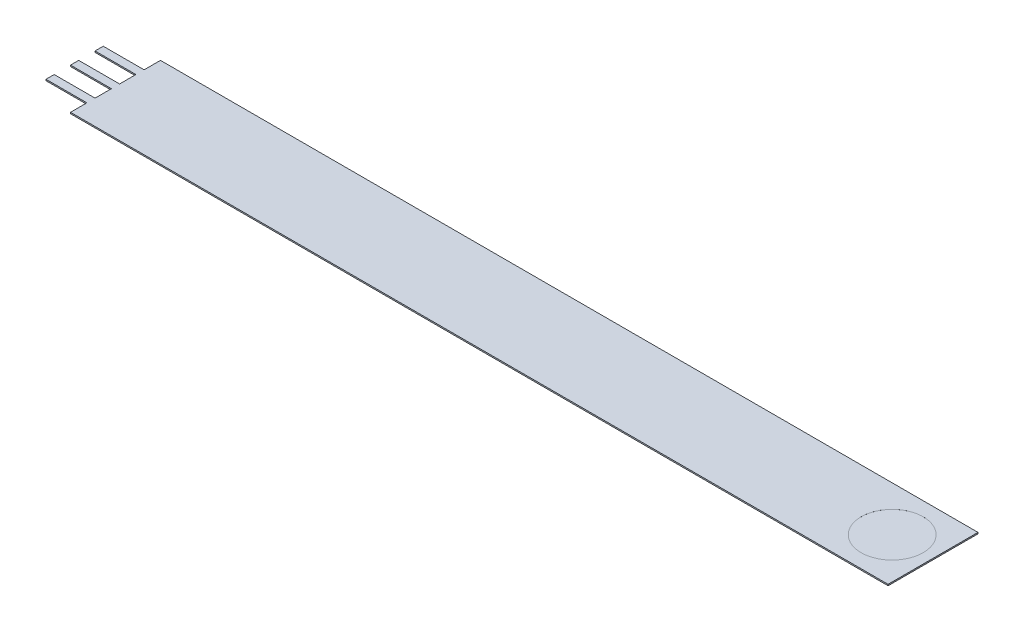
ISO-10303-21;
HEADER;
FILE_DESCRIPTION(('STEP AP214'),'2;1');
FILE_NAME('part.step','',(''),(''),'','','');
FILE_SCHEMA(('AUTOMOTIVE_DESIGN { 1 0 10303 214 1 1 1 1 }'));
ENDSEC;
DATA;
#1=APPLICATION_CONTEXT('core data for automotive mechanical design processes');
#2=APPLICATION_PROTOCOL_DEFINITION('international standard','automotive_design',2000,#1);
#3=PRODUCT_CONTEXT('',#1,'mechanical');
#4=PRODUCT('Part','Part','',(#3));
#5=PRODUCT_RELATED_PRODUCT_CATEGORY('part','',(#4));
#6=PRODUCT_DEFINITION_FORMATION('','',#4);
#7=PRODUCT_DEFINITION_CONTEXT('part definition',#1,'design');
#8=PRODUCT_DEFINITION('design','',#6,#7);
#9=PRODUCT_DEFINITION_SHAPE('','',#8);
#10=(LENGTH_UNIT() NAMED_UNIT(*) SI_UNIT(.MILLI.,.METRE.));
#11=(NAMED_UNIT(*) PLANE_ANGLE_UNIT() SI_UNIT($,.RADIAN.));
#12=(NAMED_UNIT(*) SI_UNIT($,.STERADIAN.) SOLID_ANGLE_UNIT());
#13=UNCERTAINTY_MEASURE_WITH_UNIT(LENGTH_MEASURE(1.E-05),#10,'distance_accuracy_value','');
#14=(GEOMETRIC_REPRESENTATION_CONTEXT(3) GLOBAL_UNCERTAINTY_ASSIGNED_CONTEXT((#13)) GLOBAL_UNIT_ASSIGNED_CONTEXT((#10,
#11,#12)) REPRESENTATION_CONTEXT('',''));
#15=CARTESIAN_POINT('',(0.,0.,0.));
#16=DIRECTION('',(0.,0.,1.));
#17=DIRECTION('',(1.,0.,0.));
#18=AXIS2_PLACEMENT_3D('',#15,#16,#17);
#19=CARTESIAN_POINT('',(-120.65,0.2032,-6.98499999999999));
#20=DIRECTION('',(1.,0.,0.));
#21=DIRECTION('',(0.,0.,-1.));
#22=AXIS2_PLACEMENT_3D('',#19,#20,#21);
#23=PLANE('',#22);
#24=DIRECTION('',(0.,0.,1.));
#25=VECTOR('',#24,1.);
#26=CARTESIAN_POINT('',(-120.65,0.,-6.98499999999999));
#27=LINE('',#26,#25);
#28=CARTESIAN_POINT('',(-120.65,0.,-6.98499999999999));
#29=VERTEX_POINT('',#28);
#30=CARTESIAN_POINT('',(-120.65,0.,-4.44499999999999));
#31=VERTEX_POINT('',#30);
#32=EDGE_CURVE('E189',#29,#31,#27,.T.);
#33=ORIENTED_EDGE('',*,*,#32,.T.);
#34=DIRECTION('',(0.,-1.,0.));
#35=VECTOR('',#34,1.);
#36=CARTESIAN_POINT('',(-120.65,0.2032,-4.44499999999999));
#37=LINE('',#36,#35);
#38=CARTESIAN_POINT('',(-120.65,0.2032,-4.44499999999999));
#39=VERTEX_POINT('',#38);
#40=EDGE_CURVE('E11',#39,#31,#37,.T.);
#41=ORIENTED_EDGE('',*,*,#40,.F.);
#42=DIRECTION('',(0.,0.,1.));
#43=VECTOR('',#42,1.);
#44=CARTESIAN_POINT('',(-120.65,0.2032,-6.98499999999999));
#45=LINE('',#44,#43);
#46=CARTESIAN_POINT('',(-120.65,0.2032,-6.98499999999999));
#47=VERTEX_POINT('',#46);
#48=EDGE_CURVE('E220',#47,#39,#45,.T.);
#49=ORIENTED_EDGE('',*,*,#48,.F.);
#50=DIRECTION('',(0.,-1.,0.));
#51=VECTOR('',#50,1.);
#52=CARTESIAN_POINT('',(-120.65,0.2032,-6.98499999999999));
#53=LINE('',#52,#51);
#54=EDGE_CURVE('E185',#47,#29,#53,.T.);
#55=ORIENTED_EDGE('',*,*,#54,.T.);
#56=EDGE_LOOP('',(#33,#41,#49,#55));
#57=FACE_BOUND('',#56,.T.);
#58=ADVANCED_FACE('F45',(#57),#23,.F.);
#59=CARTESIAN_POINT('',(-120.65,0.2032,-4.44499999999999));
#60=DIRECTION('',(0.,0.,1.));
#61=DIRECTION('',(1.,0.,0.));
#62=AXIS2_PLACEMENT_3D('',#59,#60,#61);
#63=PLANE('',#62);
#64=DIRECTION('',(-1.,0.,0.));
#65=VECTOR('',#64,1.);
#66=CARTESIAN_POINT('',(-120.65,0.,-4.44499999999999));
#67=LINE('',#66,#65);
#68=CARTESIAN_POINT('',(-127.,0.,-4.44499999999999));
#69=VERTEX_POINT('',#68);
#70=EDGE_CURVE('E192',#31,#69,#67,.T.);
#71=ORIENTED_EDGE('',*,*,#70,.T.);
#72=DIRECTION('',(0.,-1.,0.));
#73=VECTOR('',#72,1.);
#74=CARTESIAN_POINT('',(-127.,0.2032,-4.44499999999999));
#75=LINE('',#74,#73);
#76=CARTESIAN_POINT('',(-127.,0.2032,-4.44499999999999));
#77=VERTEX_POINT('',#76);
#78=EDGE_CURVE('E53',#77,#69,#75,.T.);
#79=ORIENTED_EDGE('',*,*,#78,.F.);
#80=DIRECTION('',(-1.,0.,0.));
#81=VECTOR('',#80,1.);
#82=CARTESIAN_POINT('',(-120.65,0.2032,-4.44499999999999));
#83=LINE('',#82,#81);
#84=EDGE_CURVE('E128',#39,#77,#83,.T.);
#85=ORIENTED_EDGE('',*,*,#84,.F.);
#86=ORIENTED_EDGE('',*,*,#40,.T.);
#87=EDGE_LOOP('',(#71,#79,#85,#86));
#88=FACE_BOUND('',#87,.T.);
#89=ADVANCED_FACE('F319',(#88),#63,.F.);
#90=CARTESIAN_POINT('',(-127.,0.2032,-3.17499999999999));
#91=DIRECTION('',(1.,0.,0.));
#92=DIRECTION('',(0.,0.,-1.));
#93=AXIS2_PLACEMENT_3D('',#90,#91,#92);
#94=PLANE('',#93);
#95=DIRECTION('',(0.,0.,1.));
#96=VECTOR('',#95,1.);
#97=CARTESIAN_POINT('',(-127.,0.,-3.17499999999999));
#98=LINE('',#97,#96);
#99=CARTESIAN_POINT('',(-127.,0.,-3.17499999999999));
#100=VERTEX_POINT('',#99);
#101=EDGE_CURVE('E195',#69,#100,#98,.T.);
#102=ORIENTED_EDGE('',*,*,#101,.T.);
#103=DIRECTION('',(0.,-1.,0.));
#104=VECTOR('',#103,1.);
#105=CARTESIAN_POINT('',(-127.,0.2032,-3.17499999999999));
#106=LINE('',#105,#104);
#107=CARTESIAN_POINT('',(-127.,0.2032,-3.17499999999999));
#108=VERTEX_POINT('',#107);
#109=EDGE_CURVE('E251',#108,#100,#106,.T.);
#110=ORIENTED_EDGE('',*,*,#109,.F.);
#111=DIRECTION('',(0.,0.,1.));
#112=VECTOR('',#111,1.);
#113=CARTESIAN_POINT('',(-127.,0.2032,-3.17499999999999));
#114=LINE('',#113,#112);
#115=EDGE_CURVE('E259',#77,#108,#114,.T.);
#116=ORIENTED_EDGE('',*,*,#115,.F.);
#117=ORIENTED_EDGE('',*,*,#78,.T.);
#118=EDGE_LOOP('',(#102,#110,#116,#117));
#119=FACE_BOUND('',#118,.T.);
#120=ADVANCED_FACE('F257',(#119),#94,.F.);
#121=CARTESIAN_POINT('',(-120.65,0.2032,-3.17499999999999));
#122=DIRECTION('',(0.,0.,-1.));
#123=DIRECTION('',(-1.,0.,0.));
#124=AXIS2_PLACEMENT_3D('',#121,#122,#123);
#125=PLANE('',#124);
#126=DIRECTION('',(1.,0.,0.));
#127=VECTOR('',#126,1.);
#128=CARTESIAN_POINT('',(-120.65,0.,-3.17499999999999));
#129=LINE('',#128,#127);
#130=CARTESIAN_POINT('',(-120.65,0.,-3.17499999999999));
#131=VERTEX_POINT('',#130);
#132=EDGE_CURVE('E197',#100,#131,#129,.T.);
#133=ORIENTED_EDGE('',*,*,#132,.T.);
#134=DIRECTION('',(0.,-1.,0.));
#135=VECTOR('',#134,1.);
#136=CARTESIAN_POINT('',(-120.65,0.2032,-3.17499999999999));
#137=LINE('',#136,#135);
#138=CARTESIAN_POINT('',(-120.65,0.2032,-3.17499999999999));
#139=VERTEX_POINT('',#138);
#140=EDGE_CURVE('E248',#139,#131,#137,.T.);
#141=ORIENTED_EDGE('',*,*,#140,.F.);
#142=DIRECTION('',(1.,0.,0.));
#143=VECTOR('',#142,1.);
#144=CARTESIAN_POINT('',(-120.65,0.2032,-3.17499999999999));
#145=LINE('',#144,#143);
#146=EDGE_CURVE('E277',#108,#139,#145,.T.);
#147=ORIENTED_EDGE('',*,*,#146,.F.);
#148=ORIENTED_EDGE('',*,*,#109,.T.);
#149=EDGE_LOOP('',(#133,#141,#147,#148));
#150=FACE_BOUND('',#149,.T.);
#151=ADVANCED_FACE('F268',(#150),#125,.F.);
#152=CARTESIAN_POINT('',(-120.65,0.2032,-3.17499999999999));
#153=DIRECTION('',(1.,0.,0.));
#154=DIRECTION('',(0.,0.,-1.));
#155=AXIS2_PLACEMENT_3D('',#152,#153,#154);
#156=PLANE('',#155);
#157=DIRECTION('',(0.,0.,1.));
#158=VECTOR('',#157,1.);
#159=CARTESIAN_POINT('',(-120.65,0.,-3.17499999999999));
#160=LINE('',#159,#158);
#161=CARTESIAN_POINT('',(-120.65,0.,-0.634999999999987));
#162=VERTEX_POINT('',#161);
#163=EDGE_CURVE('E199',#131,#162,#160,.T.);
#164=ORIENTED_EDGE('',*,*,#163,.T.);
#165=DIRECTION('',(0.,-1.,0.));
#166=VECTOR('',#165,1.);
#167=CARTESIAN_POINT('',(-120.65,0.2032,-0.634999999999987));
#168=LINE('',#167,#166);
#169=CARTESIAN_POINT('',(-120.65,0.2032,-0.634999999999987));
#170=VERTEX_POINT('',#169);
#171=EDGE_CURVE('E245',#170,#162,#168,.T.);
#172=ORIENTED_EDGE('',*,*,#171,.F.);
#173=DIRECTION('',(0.,0.,1.));
#174=VECTOR('',#173,1.);
#175=CARTESIAN_POINT('',(-120.65,0.2032,-3.17499999999999));
#176=LINE('',#175,#174);
#177=EDGE_CURVE('E274',#139,#170,#176,.T.);
#178=ORIENTED_EDGE('',*,*,#177,.F.);
#179=ORIENTED_EDGE('',*,*,#140,.T.);
#180=EDGE_LOOP('',(#164,#172,#178,#179));
#181=FACE_BOUND('',#180,.T.);
#182=ADVANCED_FACE('F272',(#181),#156,.F.);
#183=CARTESIAN_POINT('',(-120.65,0.2032,-0.634999999999987));
#184=DIRECTION('',(0.,0.,1.));
#185=DIRECTION('',(1.,0.,0.));
#186=AXIS2_PLACEMENT_3D('',#183,#184,#185);
#187=PLANE('',#186);
#188=DIRECTION('',(-1.,0.,0.));
#189=VECTOR('',#188,1.);
#190=CARTESIAN_POINT('',(-120.65,0.,-0.634999999999987));
#191=LINE('',#190,#189);
#192=CARTESIAN_POINT('',(-127.,0.,-0.634999999999988));
#193=VERTEX_POINT('',#192);
#194=EDGE_CURVE('E201',#162,#193,#191,.T.);
#195=ORIENTED_EDGE('',*,*,#194,.T.);
#196=DIRECTION('',(0.,-1.,0.));
#197=VECTOR('',#196,1.);
#198=CARTESIAN_POINT('',(-127.,0.2032,-0.634999999999988));
#199=LINE('',#198,#197);
#200=CARTESIAN_POINT('',(-127.,0.2032,-0.634999999999988));
#201=VERTEX_POINT('',#200);
#202=EDGE_CURVE('E242',#201,#193,#199,.T.);
#203=ORIENTED_EDGE('',*,*,#202,.F.);
#204=DIRECTION('',(-1.,0.,0.));
#205=VECTOR('',#204,1.);
#206=CARTESIAN_POINT('',(-120.65,0.2032,-0.634999999999987));
#207=LINE('',#206,#205);
#208=EDGE_CURVE('E276',#170,#201,#207,.T.);
#209=ORIENTED_EDGE('',*,*,#208,.F.);
#210=ORIENTED_EDGE('',*,*,#171,.T.);
#211=EDGE_LOOP('',(#195,#203,#209,#210));
#212=FACE_BOUND('',#211,.T.);
#213=ADVANCED_FACE('F332',(#212),#187,.F.);
#214=CARTESIAN_POINT('',(-127.,0.2032,0.635000000000013));
#215=DIRECTION('',(1.,0.,0.));
#216=DIRECTION('',(0.,0.,-1.));
#217=AXIS2_PLACEMENT_3D('',#214,#215,#216);
#218=PLANE('',#217);
#219=DIRECTION('',(0.,0.,1.));
#220=VECTOR('',#219,1.);
#221=CARTESIAN_POINT('',(-127.,0.,0.635000000000013));
#222=LINE('',#221,#220);
#223=CARTESIAN_POINT('',(-127.,0.,0.635000000000013));
#224=VERTEX_POINT('',#223);
#225=EDGE_CURVE('E203',#193,#224,#222,.T.);
#226=ORIENTED_EDGE('',*,*,#225,.T.);
#227=DIRECTION('',(0.,-1.,0.));
#228=VECTOR('',#227,1.);
#229=CARTESIAN_POINT('',(-127.,0.2032,0.635000000000013));
#230=LINE('',#229,#228);
#231=CARTESIAN_POINT('',(-127.,0.2032,0.635000000000013));
#232=VERTEX_POINT('',#231);
#233=EDGE_CURVE('E239',#232,#224,#230,.T.);
#234=ORIENTED_EDGE('',*,*,#233,.F.);
#235=DIRECTION('',(0.,0.,1.));
#236=VECTOR('',#235,1.);
#237=CARTESIAN_POINT('',(-127.,0.2032,0.635000000000013));
#238=LINE('',#237,#236);
#239=EDGE_CURVE('E279',#201,#232,#238,.T.);
#240=ORIENTED_EDGE('',*,*,#239,.F.);
#241=ORIENTED_EDGE('',*,*,#202,.T.);
#242=EDGE_LOOP('',(#226,#234,#240,#241));
#243=FACE_BOUND('',#242,.T.);
#244=ADVANCED_FACE('F335',(#243),#218,.F.);
#245=CARTESIAN_POINT('',(-120.65,0.2032,0.635000000000012));
#246=DIRECTION('',(0.,0.,-1.));
#247=DIRECTION('',(-1.,0.,0.));
#248=AXIS2_PLACEMENT_3D('',#245,#246,#247);
#249=PLANE('',#248);
#250=DIRECTION('',(1.,0.,0.));
#251=VECTOR('',#250,1.);
#252=CARTESIAN_POINT('',(-120.65,0.,0.635000000000012));
#253=LINE('',#252,#251);
#254=CARTESIAN_POINT('',(-120.65,0.,0.635000000000012));
#255=VERTEX_POINT('',#254);
#256=EDGE_CURVE('E205',#224,#255,#253,.T.);
#257=ORIENTED_EDGE('',*,*,#256,.T.);
#258=DIRECTION('',(0.,-1.,0.));
#259=VECTOR('',#258,1.);
#260=CARTESIAN_POINT('',(-120.65,0.2032,0.635000000000012));
#261=LINE('',#260,#259);
#262=CARTESIAN_POINT('',(-120.65,0.2032,0.635000000000012));
#263=VERTEX_POINT('',#262);
#264=EDGE_CURVE('E236',#263,#255,#261,.T.);
#265=ORIENTED_EDGE('',*,*,#264,.F.);
#266=DIRECTION('',(1.,0.,0.));
#267=VECTOR('',#266,1.);
#268=CARTESIAN_POINT('',(-120.65,0.2032,0.635000000000012));
#269=LINE('',#268,#267);
#270=EDGE_CURVE('E285',#232,#263,#269,.T.);
#271=ORIENTED_EDGE('',*,*,#270,.F.);
#272=ORIENTED_EDGE('',*,*,#233,.T.);
#273=EDGE_LOOP('',(#257,#265,#271,#272));
#274=FACE_BOUND('',#273,.T.);
#275=ADVANCED_FACE('F339',(#274),#249,.F.);
#276=CARTESIAN_POINT('',(-120.65,0.2032,0.635000000000012));
#277=DIRECTION('',(1.,0.,0.));
#278=DIRECTION('',(0.,0.,-1.));
#279=AXIS2_PLACEMENT_3D('',#276,#277,#278);
#280=PLANE('',#279);
#281=DIRECTION('',(0.,0.,1.));
#282=VECTOR('',#281,1.);
#283=CARTESIAN_POINT('',(-120.65,0.,0.635000000000012));
#284=LINE('',#283,#282);
#285=CARTESIAN_POINT('',(-120.65,0.,3.17500000000001));
#286=VERTEX_POINT('',#285);
#287=EDGE_CURVE('E207',#255,#286,#284,.T.);
#288=ORIENTED_EDGE('',*,*,#287,.T.);
#289=DIRECTION('',(0.,-1.,0.));
#290=VECTOR('',#289,1.);
#291=CARTESIAN_POINT('',(-120.65,0.2032,3.17500000000001));
#292=LINE('',#291,#290);
#293=CARTESIAN_POINT('',(-120.65,0.2032,3.17500000000001));
#294=VERTEX_POINT('',#293);
#295=EDGE_CURVE('E233',#294,#286,#292,.T.);
#296=ORIENTED_EDGE('',*,*,#295,.F.);
#297=DIRECTION('',(0.,0.,1.));
#298=VECTOR('',#297,1.);
#299=CARTESIAN_POINT('',(-120.65,0.2032,0.635000000000012));
#300=LINE('',#299,#298);
#301=EDGE_CURVE('E287',#263,#294,#300,.T.);
#302=ORIENTED_EDGE('',*,*,#301,.F.);
#303=ORIENTED_EDGE('',*,*,#264,.T.);
#304=EDGE_LOOP('',(#288,#296,#302,#303));
#305=FACE_BOUND('',#304,.T.);
#306=ADVANCED_FACE('F343',(#305),#280,.F.);
#307=CARTESIAN_POINT('',(-120.65,0.2032,3.17500000000001));
#308=DIRECTION('',(0.,0.,1.));
#309=DIRECTION('',(1.,0.,0.));
#310=AXIS2_PLACEMENT_3D('',#307,#308,#309);
#311=PLANE('',#310);
#312=DIRECTION('',(-1.,0.,0.));
#313=VECTOR('',#312,1.);
#314=CARTESIAN_POINT('',(-120.65,0.,3.17500000000001));
#315=LINE('',#314,#313);
#316=CARTESIAN_POINT('',(-127.,0.,3.17500000000001));
#317=VERTEX_POINT('',#316);
#318=EDGE_CURVE('E209',#286,#317,#315,.T.);
#319=ORIENTED_EDGE('',*,*,#318,.T.);
#320=DIRECTION('',(0.,-1.,0.));
#321=VECTOR('',#320,1.);
#322=CARTESIAN_POINT('',(-127.,0.2032,3.17500000000001));
#323=LINE('',#322,#321);
#324=CARTESIAN_POINT('',(-127.,0.2032,3.17500000000001));
#325=VERTEX_POINT('',#324);
#326=EDGE_CURVE('E230',#325,#317,#323,.T.);
#327=ORIENTED_EDGE('',*,*,#326,.F.);
#328=DIRECTION('',(-1.,0.,0.));
#329=VECTOR('',#328,1.);
#330=CARTESIAN_POINT('',(-120.65,0.2032,3.17500000000001));
#331=LINE('',#330,#329);
#332=EDGE_CURVE('E289',#294,#325,#331,.T.);
#333=ORIENTED_EDGE('',*,*,#332,.F.);
#334=ORIENTED_EDGE('',*,*,#295,.T.);
#335=EDGE_LOOP('',(#319,#327,#333,#334));
#336=FACE_BOUND('',#335,.T.);
#337=ADVANCED_FACE('F347',(#336),#311,.F.);
#338=CARTESIAN_POINT('',(-127.,0.2032,3.17500000000001));
#339=DIRECTION('',(1.,0.,0.));
#340=DIRECTION('',(0.,0.,-1.));
#341=AXIS2_PLACEMENT_3D('',#338,#339,#340);
#342=PLANE('',#341);
#343=DIRECTION('',(0.,0.,1.));
#344=VECTOR('',#343,1.);
#345=CARTESIAN_POINT('',(-127.,0.,3.17500000000001));
#346=LINE('',#345,#344);
#347=CARTESIAN_POINT('',(-127.,0.,4.44500000000001));
#348=VERTEX_POINT('',#347);
#349=EDGE_CURVE('E211',#317,#348,#346,.T.);
#350=ORIENTED_EDGE('',*,*,#349,.T.);
#351=DIRECTION('',(0.,-1.,0.));
#352=VECTOR('',#351,1.);
#353=CARTESIAN_POINT('',(-127.,0.2032,4.44500000000001));
#354=LINE('',#353,#352);
#355=CARTESIAN_POINT('',(-127.,0.2032,4.44500000000001));
#356=VERTEX_POINT('',#355);
#357=EDGE_CURVE('E227',#356,#348,#354,.T.);
#358=ORIENTED_EDGE('',*,*,#357,.F.);
#359=DIRECTION('',(0.,0.,1.));
#360=VECTOR('',#359,1.);
#361=CARTESIAN_POINT('',(-127.,0.2032,3.17500000000001));
#362=LINE('',#361,#360);
#363=EDGE_CURVE('E291',#325,#356,#362,.T.);
#364=ORIENTED_EDGE('',*,*,#363,.F.);
#365=ORIENTED_EDGE('',*,*,#326,.T.);
#366=EDGE_LOOP('',(#350,#358,#364,#365));
#367=FACE_BOUND('',#366,.T.);
#368=ADVANCED_FACE('F351',(#367),#342,.F.);
#369=CARTESIAN_POINT('',(-120.65,0.2032,4.44500000000001));
#370=DIRECTION('',(0.,0.,-1.));
#371=DIRECTION('',(-1.,0.,0.));
#372=AXIS2_PLACEMENT_3D('',#369,#370,#371);
#373=PLANE('',#372);
#374=DIRECTION('',(1.,0.,0.));
#375=VECTOR('',#374,1.);
#376=CARTESIAN_POINT('',(-120.65,0.,4.44500000000001));
#377=LINE('',#376,#375);
#378=CARTESIAN_POINT('',(-120.65,0.,4.44500000000001));
#379=VERTEX_POINT('',#378);
#380=EDGE_CURVE('E213',#348,#379,#377,.T.);
#381=ORIENTED_EDGE('',*,*,#380,.T.);
#382=DIRECTION('',(0.,-1.,0.));
#383=VECTOR('',#382,1.);
#384=CARTESIAN_POINT('',(-120.65,0.2032,4.44500000000001));
#385=LINE('',#384,#383);
#386=CARTESIAN_POINT('',(-120.65,0.2032,4.44500000000001));
#387=VERTEX_POINT('',#386);
#388=EDGE_CURVE('E224',#387,#379,#385,.T.);
#389=ORIENTED_EDGE('',*,*,#388,.F.);
#390=DIRECTION('',(1.,0.,0.));
#391=VECTOR('',#390,1.);
#392=CARTESIAN_POINT('',(-120.65,0.2032,4.44500000000001));
#393=LINE('',#392,#391);
#394=EDGE_CURVE('E293',#356,#387,#393,.T.);
#395=ORIENTED_EDGE('',*,*,#394,.F.);
#396=ORIENTED_EDGE('',*,*,#357,.T.);
#397=EDGE_LOOP('',(#381,#389,#395,#396));
#398=FACE_BOUND('',#397,.T.);
#399=ADVANCED_FACE('F299',(#398),#373,.F.);
#400=CARTESIAN_POINT('',(-120.65,0.2032,4.44500000000001));
#401=DIRECTION('',(1.,0.,0.));
#402=DIRECTION('',(0.,0.,-1.));
#403=AXIS2_PLACEMENT_3D('',#400,#401,#402);
#404=PLANE('',#403);
#405=DIRECTION('',(0.,0.,1.));
#406=VECTOR('',#405,1.);
#407=CARTESIAN_POINT('',(-120.65,0.,4.44500000000001));
#408=LINE('',#407,#406);
#409=CARTESIAN_POINT('',(-120.65,0.,6.98500000000001));
#410=VERTEX_POINT('',#409);
#411=EDGE_CURVE('E215',#379,#410,#408,.T.);
#412=ORIENTED_EDGE('',*,*,#411,.T.);
#413=DIRECTION('',(0.,-1.,0.));
#414=VECTOR('',#413,1.);
#415=CARTESIAN_POINT('',(-120.65,0.2032,6.98500000000001));
#416=LINE('',#415,#414);
#417=CARTESIAN_POINT('',(-120.65,0.2032,6.98500000000001));
#418=VERTEX_POINT('',#417);
#419=EDGE_CURVE('E180',#418,#410,#416,.T.);
#420=ORIENTED_EDGE('',*,*,#419,.F.);
#421=DIRECTION('',(0.,0.,1.));
#422=VECTOR('',#421,1.);
#423=CARTESIAN_POINT('',(-120.65,0.2032,4.44500000000001));
#424=LINE('',#423,#422);
#425=EDGE_CURVE('E171',#387,#418,#424,.T.);
#426=ORIENTED_EDGE('',*,*,#425,.F.);
#427=ORIENTED_EDGE('',*,*,#388,.T.);
#428=EDGE_LOOP('',(#412,#420,#426,#427));
#429=FACE_BOUND('',#428,.T.);
#430=ADVANCED_FACE('F303',(#429),#404,.F.);
#431=CARTESIAN_POINT('',(-120.65,0.2032,6.98500000000001));
#432=DIRECTION('',(0.,0.,-1.));
#433=DIRECTION('',(-1.,0.,0.));
#434=AXIS2_PLACEMENT_3D('',#431,#432,#433);
#435=PLANE('',#434);
#436=DIRECTION('',(1.,0.,0.));
#437=VECTOR('',#436,1.);
#438=CARTESIAN_POINT('',(-120.65,0.,6.98500000000001));
#439=LINE('',#438,#437);
#440=CARTESIAN_POINT('',(6.35,0.,6.98500000000001));
#441=VERTEX_POINT('',#440);
#442=EDGE_CURVE('E179',#410,#441,#439,.T.);
#443=ORIENTED_EDGE('',*,*,#442,.T.);
#444=DIRECTION('',(0.,-1.,0.));
#445=VECTOR('',#444,1.);
#446=CARTESIAN_POINT('',(6.35,0.2032,6.98500000000001));
#447=LINE('',#446,#445);
#448=CARTESIAN_POINT('',(6.35,0.2032,6.98500000000001));
#449=VERTEX_POINT('',#448);
#450=EDGE_CURVE('E176',#449,#441,#447,.T.);
#451=ORIENTED_EDGE('',*,*,#450,.F.);
#452=DIRECTION('',(1.,0.,0.));
#453=VECTOR('',#452,1.);
#454=CARTESIAN_POINT('',(-120.65,0.2032,6.98500000000001));
#455=LINE('',#454,#453);
#456=EDGE_CURVE('E165',#418,#449,#455,.T.);
#457=ORIENTED_EDGE('',*,*,#456,.F.);
#458=ORIENTED_EDGE('',*,*,#419,.T.);
#459=EDGE_LOOP('',(#443,#451,#457,#458));
#460=FACE_BOUND('',#459,.T.);
#461=ADVANCED_FACE('F177',(#460),#435,.F.);
#462=CARTESIAN_POINT('',(6.35,0.2032,-6.98499999999999));
#463=DIRECTION('',(-1.,0.,0.));
#464=DIRECTION('',(0.,0.,1.));
#465=AXIS2_PLACEMENT_3D('',#462,#463,#464);
#466=PLANE('',#465);
#467=DIRECTION('',(0.,0.,-1.));
#468=VECTOR('',#467,1.);
#469=CARTESIAN_POINT('',(6.35,0.,-6.98499999999999));
#470=LINE('',#469,#468);
#471=CARTESIAN_POINT('',(6.35,0.,-6.98499999999999));
#472=VERTEX_POINT('',#471);
#473=EDGE_CURVE('E114',#441,#472,#470,.T.);
#474=ORIENTED_EDGE('',*,*,#473,.T.);
#475=DIRECTION('',(0.,-1.,0.));
#476=VECTOR('',#475,1.);
#477=CARTESIAN_POINT('',(6.35,0.2032,-6.98499999999999));
#478=LINE('',#477,#476);
#479=CARTESIAN_POINT('',(6.35,0.2032,-6.98499999999999));
#480=VERTEX_POINT('',#479);
#481=EDGE_CURVE('E181',#480,#472,#478,.T.);
#482=ORIENTED_EDGE('',*,*,#481,.F.);
#483=DIRECTION('',(0.,0.,-1.));
#484=VECTOR('',#483,1.);
#485=CARTESIAN_POINT('',(6.35,0.2032,-6.98499999999999));
#486=LINE('',#485,#484);
#487=EDGE_CURVE('E169',#449,#480,#486,.T.);
#488=ORIENTED_EDGE('',*,*,#487,.F.);
#489=ORIENTED_EDGE('',*,*,#450,.T.);
#490=EDGE_LOOP('',(#474,#482,#488,#489));
#491=FACE_BOUND('',#490,.T.);
#492=ADVANCED_FACE('F183',(#491),#466,.F.);
#493=CARTESIAN_POINT('',(-120.65,0.2032,-6.98499999999999));
#494=DIRECTION('',(0.,0.,1.));
#495=DIRECTION('',(1.,0.,0.));
#496=AXIS2_PLACEMENT_3D('',#493,#494,#495);
#497=PLANE('',#496);
#498=DIRECTION('',(-1.,0.,0.));
#499=VECTOR('',#498,1.);
#500=CARTESIAN_POINT('',(-120.65,0.,-6.98499999999999));
#501=LINE('',#500,#499);
#502=EDGE_CURVE('E120',#472,#29,#501,.T.);
#503=ORIENTED_EDGE('',*,*,#502,.T.);
#504=ORIENTED_EDGE('',*,*,#54,.F.);
#505=DIRECTION('',(-1.,0.,0.));
#506=VECTOR('',#505,1.);
#507=CARTESIAN_POINT('',(-120.65,0.2032,-6.98499999999999));
#508=LINE('',#507,#506);
#509=EDGE_CURVE('E61',#480,#47,#508,.T.);
#510=ORIENTED_EDGE('',*,*,#509,.F.);
#511=ORIENTED_EDGE('',*,*,#481,.T.);
#512=EDGE_LOOP('',(#503,#504,#510,#511));
#513=FACE_BOUND('',#512,.T.);
#514=ADVANCED_FACE('F307',(#513),#497,.F.);
#515=CARTESIAN_POINT('',(0.,0.2032,0.));
#516=DIRECTION('',(0.,-1.,0.));
#517=DIRECTION('',(0.,0.,-1.));
#518=AXIS2_PLACEMENT_3D('',#515,#516,#517);
#519=PLANE('',#518);
#520=CARTESIAN_POINT('',(0.,0.2032,0.));
#521=DIRECTION('',(0.,1.,0.));
#522=DIRECTION('',(0.,0.,1.));
#523=AXIS2_PLACEMENT_3D('',#520,#521,#522);
#524=CIRCLE('',#523,4.826);
#525=CARTESIAN_POINT('',(0.,0.2032,4.826));
#526=VERTEX_POINT('',#525);
#527=EDGE_CURVE('E606',#526,#526,#524,.T.);
#528=ORIENTED_EDGE('',*,*,#527,.F.);
#529=EDGE_LOOP('',(#528));
#530=FACE_BOUND('',#529,.T.);
#531=ORIENTED_EDGE('',*,*,#48,.T.);
#532=ORIENTED_EDGE('',*,*,#84,.T.);
#533=ORIENTED_EDGE('',*,*,#115,.T.);
#534=ORIENTED_EDGE('',*,*,#146,.T.);
#535=ORIENTED_EDGE('',*,*,#177,.T.);
#536=ORIENTED_EDGE('',*,*,#208,.T.);
#537=ORIENTED_EDGE('',*,*,#239,.T.);
#538=ORIENTED_EDGE('',*,*,#270,.T.);
#539=ORIENTED_EDGE('',*,*,#301,.T.);
#540=ORIENTED_EDGE('',*,*,#332,.T.);
#541=ORIENTED_EDGE('',*,*,#363,.T.);
#542=ORIENTED_EDGE('',*,*,#394,.T.);
#543=ORIENTED_EDGE('',*,*,#425,.T.);
#544=ORIENTED_EDGE('',*,*,#456,.T.);
#545=ORIENTED_EDGE('',*,*,#487,.T.);
#546=ORIENTED_EDGE('',*,*,#509,.T.);
#547=EDGE_LOOP('',(#531,#532,#533,#534,#535,#536,#537,#538,#539,#540,#541,#542,#543,#544,#545,#546));
#548=FACE_BOUND('',#547,.T.);
#549=ADVANCED_FACE('F167',(#530,#548),#519,.F.);
#550=CARTESIAN_POINT('',(0.,0.,0.));
#551=DIRECTION('',(0.,-1.,0.));
#552=DIRECTION('',(0.,0.,-1.));
#553=AXIS2_PLACEMENT_3D('',#550,#551,#552);
#554=PLANE('',#553);
#555=ORIENTED_EDGE('',*,*,#32,.F.);
#556=ORIENTED_EDGE('',*,*,#502,.F.);
#557=ORIENTED_EDGE('',*,*,#473,.F.);
#558=ORIENTED_EDGE('',*,*,#442,.F.);
#559=ORIENTED_EDGE('',*,*,#411,.F.);
#560=ORIENTED_EDGE('',*,*,#380,.F.);
#561=ORIENTED_EDGE('',*,*,#349,.F.);
#562=ORIENTED_EDGE('',*,*,#318,.F.);
#563=ORIENTED_EDGE('',*,*,#287,.F.);
#564=ORIENTED_EDGE('',*,*,#256,.F.);
#565=ORIENTED_EDGE('',*,*,#225,.F.);
#566=ORIENTED_EDGE('',*,*,#194,.F.);
#567=ORIENTED_EDGE('',*,*,#163,.F.);
#568=ORIENTED_EDGE('',*,*,#132,.F.);
#569=ORIENTED_EDGE('',*,*,#101,.F.);
#570=ORIENTED_EDGE('',*,*,#70,.F.);
#571=EDGE_LOOP('',(#555,#556,#557,#558,#559,#560,#561,#562,#563,#564,#565,#566,#567,#568,#569,#570));
#572=FACE_BOUND('',#571,.T.);
#573=ADVANCED_FACE('F263',(#572),#554,.T.);
#574=CARTESIAN_POINT('',(0.,0.20066,0.));
#575=DIRECTION('',(0.,1.,0.));
#576=DIRECTION('',(0.,0.,1.));
#577=AXIS2_PLACEMENT_3D('',#574,#575,#576);
#578=CYLINDRICAL_SURFACE('',#577,4.826);
#579=CARTESIAN_POINT('',(0.,0.20066,0.));
#580=DIRECTION('',(0.,1.,0.));
#581=DIRECTION('',(0.,0.,1.));
#582=AXIS2_PLACEMENT_3D('',#579,#580,#581);
#583=CIRCLE('',#582,4.826);
#584=CARTESIAN_POINT('',(0.,0.20066,4.826));
#585=VERTEX_POINT('',#584);
#586=EDGE_CURVE('E193',#585,#585,#583,.T.);
#587=ORIENTED_EDGE('',*,*,#586,.F.);
#588=EDGE_LOOP('',(#587));
#589=FACE_BOUND('',#588,.T.);
#590=ORIENTED_EDGE('',*,*,#527,.T.);
#591=EDGE_LOOP('',(#590));
#592=FACE_BOUND('',#591,.T.);
#593=ADVANCED_FACE('F388',(#589,#592),#578,.F.);
#594=CARTESIAN_POINT('',(0.,0.20066,0.));
#595=DIRECTION('',(0.,1.,0.));
#596=DIRECTION('',(0.,0.,1.));
#597=AXIS2_PLACEMENT_3D('',#594,#595,#596);
#598=PLANE('',#597);
#599=ORIENTED_EDGE('',*,*,#586,.T.);
#600=EDGE_LOOP('',(#599));
#601=FACE_BOUND('',#600,.T.);
#602=ADVANCED_FACE('F396',(#601),#598,.T.);
#603=CLOSED_SHELL('',(#58,#89,#120,#151,#182,#213,#244,#275,#306,#337,#368,#399,#430,#461,#492,
#514,#549,#573,#593,#602));
#604=MANIFOLD_SOLID_BREP('B2',#603);
#605=ADVANCED_BREP_SHAPE_REPRESENTATION('',(#18,#604),#14);
#606=SHAPE_DEFINITION_REPRESENTATION(#9,#605);
ENDSEC;
END-ISO-10303-21;
